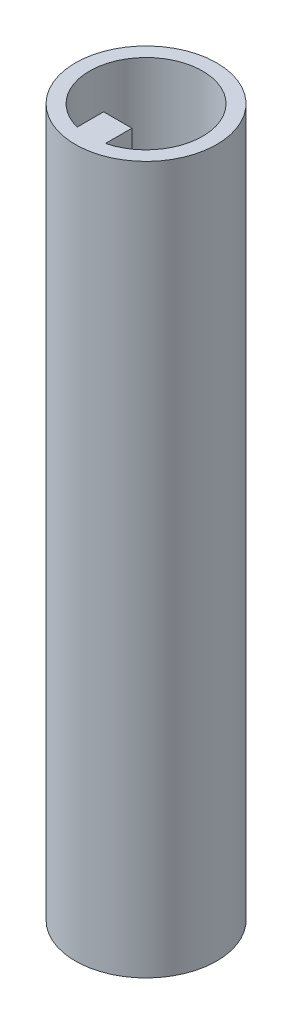
ISO-10303-21;
HEADER;
FILE_DESCRIPTION(('STEP AP214'),'2;1');
FILE_NAME('part.step','',(''),(''),'','','');
FILE_SCHEMA(('AUTOMOTIVE_DESIGN { 1 0 10303 214 1 1 1 1 }'));
ENDSEC;
DATA;
#1=APPLICATION_CONTEXT('core data for automotive mechanical design processes');
#2=APPLICATION_PROTOCOL_DEFINITION('international standard','automotive_design',2000,#1);
#3=PRODUCT_CONTEXT('',#1,'mechanical');
#4=PRODUCT('Part','Part','',(#3));
#5=PRODUCT_RELATED_PRODUCT_CATEGORY('part','',(#4));
#6=PRODUCT_DEFINITION_FORMATION('','',#4);
#7=PRODUCT_DEFINITION_CONTEXT('part definition',#1,'design');
#8=PRODUCT_DEFINITION('design','',#6,#7);
#9=PRODUCT_DEFINITION_SHAPE('','',#8);
#10=(LENGTH_UNIT() NAMED_UNIT(*) SI_UNIT(.MILLI.,.METRE.));
#11=(NAMED_UNIT(*) PLANE_ANGLE_UNIT() SI_UNIT($,.RADIAN.));
#12=(NAMED_UNIT(*) SI_UNIT($,.STERADIAN.) SOLID_ANGLE_UNIT());
#13=UNCERTAINTY_MEASURE_WITH_UNIT(LENGTH_MEASURE(1.E-05),#10,'distance_accuracy_value','');
#14=(GEOMETRIC_REPRESENTATION_CONTEXT(3) GLOBAL_UNCERTAINTY_ASSIGNED_CONTEXT((#13)) GLOBAL_UNIT_ASSIGNED_CONTEXT((#10,
#11,#12)) REPRESENTATION_CONTEXT('',''));
#15=CARTESIAN_POINT('',(0.,0.,0.));
#16=DIRECTION('',(0.,0.,1.));
#17=DIRECTION('',(1.,0.,0.));
#18=AXIS2_PLACEMENT_3D('',#15,#16,#17);
#19=CARTESIAN_POINT('',(-3.03941436278194,-156.611885126808,30.6195109088026));
#20=DIRECTION('',(0.,1.,0.));
#21=DIRECTION('',(0.,0.,1.));
#22=AXIS2_PLACEMENT_3D('',#19,#20,#21);
#23=CYLINDRICAL_SURFACE('',#22,8.);
#24=DIRECTION('',(0.,1.,0.));
#25=VECTOR('',#24,1.);
#26=CARTESIAN_POINT('',(-5.03941436278194,-156.611885126808,38.3654776012174));
#27=LINE('',#26,#25);
#28=CARTESIAN_POINT('',(-5.03941436278194,-153.611885126808,38.3654776012174));
#29=VERTEX_POINT('',#28);
#30=CARTESIAN_POINT('',(-5.03941436278194,-56.6118851268083,38.3654776012174));
#31=VERTEX_POINT('',#30);
#32=EDGE_CURVE('E55',#29,#31,#27,.T.);
#33=ORIENTED_EDGE('',*,*,#32,.F.);
#34=CARTESIAN_POINT('',(-3.03941436278194,-153.611885126808,30.6195109088026));
#35=DIRECTION('',(0.,-1.,0.));
#36=DIRECTION('',(0.,0.,-1.));
#37=AXIS2_PLACEMENT_3D('',#34,#35,#36);
#38=CIRCLE('',#37,8.);
#39=CARTESIAN_POINT('',(-1.03941436278194,-153.611885126808,38.3654776012174));
#40=VERTEX_POINT('',#39);
#41=EDGE_CURVE('E49',#29,#40,#38,.T.);
#42=ORIENTED_EDGE('',*,*,#41,.T.);
#43=DIRECTION('',(0.,1.,0.));
#44=VECTOR('',#43,1.);
#45=CARTESIAN_POINT('',(-1.03941436278194,-156.611885126808,38.3654776012174));
#46=LINE('',#45,#44);
#47=CARTESIAN_POINT('',(-1.03941436278194,-56.6118851268083,38.3654776012174));
#48=VERTEX_POINT('',#47);
#49=EDGE_CURVE('E92',#40,#48,#46,.T.);
#50=ORIENTED_EDGE('',*,*,#49,.T.);
#51=CARTESIAN_POINT('',(-3.03941436278194,-56.6118851268083,30.6195109088026));
#52=DIRECTION('',(0.,-1.,0.));
#53=DIRECTION('',(0.,0.,-1.));
#54=AXIS2_PLACEMENT_3D('',#51,#52,#53);
#55=CIRCLE('',#54,8.);
#56=EDGE_CURVE('E124',#31,#48,#55,.T.);
#57=ORIENTED_EDGE('',*,*,#56,.F.);
#58=EDGE_LOOP('',(#33,#42,#50,#57));
#59=FACE_BOUND('',#58,.T.);
#60=ADVANCED_FACE('F32',(#59),#23,.F.);
#61=CARTESIAN_POINT('',(-1.03941436278194,-156.611885126808,38.3654776012174));
#62=DIRECTION('',(1.,0.,0.));
#63=DIRECTION('',(0.,0.,-1.));
#64=AXIS2_PLACEMENT_3D('',#61,#62,#63);
#65=PLANE('',#64);
#66=ORIENTED_EDGE('',*,*,#49,.F.);
#67=DIRECTION('',(0.,0.,-1.));
#68=VECTOR('',#67,1.);
#69=CARTESIAN_POINT('',(-1.03941436278194,-153.611885126808,38.3654776012174));
#70=LINE('',#69,#68);
#71=CARTESIAN_POINT('',(-1.03941436278194,-153.611885126808,34.6195109088026));
#72=VERTEX_POINT('',#71);
#73=EDGE_CURVE('E84',#40,#72,#70,.T.);
#74=ORIENTED_EDGE('',*,*,#73,.T.);
#75=DIRECTION('',(0.,1.,0.));
#76=VECTOR('',#75,1.);
#77=CARTESIAN_POINT('',(-1.03941436278194,-156.611885126808,34.6195109088026));
#78=LINE('',#77,#76);
#79=CARTESIAN_POINT('',(-1.03941436278194,-56.6118851268083,34.6195109088026));
#80=VERTEX_POINT('',#79);
#81=EDGE_CURVE('E83',#72,#80,#78,.T.);
#82=ORIENTED_EDGE('',*,*,#81,.T.);
#83=DIRECTION('',(0.,0.,-1.));
#84=VECTOR('',#83,1.);
#85=CARTESIAN_POINT('',(-1.03941436278194,-56.6118851268083,38.3654776012174));
#86=LINE('',#85,#84);
#87=EDGE_CURVE('E127',#48,#80,#86,.T.);
#88=ORIENTED_EDGE('',*,*,#87,.F.);
#89=EDGE_LOOP('',(#66,#74,#82,#88));
#90=FACE_BOUND('',#89,.T.);
#91=ADVANCED_FACE('F136',(#90),#65,.T.);
#92=CARTESIAN_POINT('',(-1.03941436278194,-156.611885126808,34.6195109088026));
#93=DIRECTION('',(0.,0.,-1.));
#94=DIRECTION('',(-1.,0.,0.));
#95=AXIS2_PLACEMENT_3D('',#92,#93,#94);
#96=PLANE('',#95);
#97=ORIENTED_EDGE('',*,*,#81,.F.);
#98=DIRECTION('',(-1.,0.,0.));
#99=VECTOR('',#98,1.);
#100=CARTESIAN_POINT('',(-1.03941436278194,-153.611885126808,34.6195109088026));
#101=LINE('',#100,#99);
#102=CARTESIAN_POINT('',(-5.03941436278194,-153.611885126808,34.6195109088026));
#103=VERTEX_POINT('',#102);
#104=EDGE_CURVE('E75',#72,#103,#101,.T.);
#105=ORIENTED_EDGE('',*,*,#104,.T.);
#106=DIRECTION('',(0.,1.,0.));
#107=VECTOR('',#106,1.);
#108=CARTESIAN_POINT('',(-5.03941436278194,-156.611885126808,34.6195109088026));
#109=LINE('',#108,#107);
#110=CARTESIAN_POINT('',(-5.03941436278194,-56.6118851268083,34.6195109088026));
#111=VERTEX_POINT('',#110);
#112=EDGE_CURVE('E82',#103,#111,#109,.T.);
#113=ORIENTED_EDGE('',*,*,#112,.T.);
#114=DIRECTION('',(-1.,0.,0.));
#115=VECTOR('',#114,1.);
#116=CARTESIAN_POINT('',(-1.03941436278194,-56.6118851268083,34.6195109088026));
#117=LINE('',#116,#115);
#118=EDGE_CURVE('E130',#80,#111,#117,.T.);
#119=ORIENTED_EDGE('',*,*,#118,.F.);
#120=EDGE_LOOP('',(#97,#105,#113,#119));
#121=FACE_BOUND('',#120,.T.);
#122=ADVANCED_FACE('F80',(#121),#96,.T.);
#123=CARTESIAN_POINT('',(-5.03941436278194,-156.611885126808,34.6195109088026));
#124=DIRECTION('',(-1.,0.,0.));
#125=DIRECTION('',(0.,0.,1.));
#126=AXIS2_PLACEMENT_3D('',#123,#124,#125);
#127=PLANE('',#126);
#128=ORIENTED_EDGE('',*,*,#112,.F.);
#129=DIRECTION('',(0.,0.,1.));
#130=VECTOR('',#129,1.);
#131=CARTESIAN_POINT('',(-5.03941436278194,-153.611885126808,34.6195109088026));
#132=LINE('',#131,#130);
#133=EDGE_CURVE('E11',#103,#29,#132,.T.);
#134=ORIENTED_EDGE('',*,*,#133,.T.);
#135=ORIENTED_EDGE('',*,*,#32,.T.);
#136=DIRECTION('',(0.,0.,1.));
#137=VECTOR('',#136,1.);
#138=CARTESIAN_POINT('',(-5.03941436278194,-56.6118851268083,34.6195109088026));
#139=LINE('',#138,#137);
#140=EDGE_CURVE('E89',#111,#31,#139,.T.);
#141=ORIENTED_EDGE('',*,*,#140,.F.);
#142=EDGE_LOOP('',(#128,#134,#135,#141));
#143=FACE_BOUND('',#142,.T.);
#144=ADVANCED_FACE('F87',(#143),#127,.T.);
#145=CARTESIAN_POINT('',(-3.03941436278194,-156.611885126808,30.6195109088026));
#146=DIRECTION('',(0.,-1.,0.));
#147=DIRECTION('',(0.,0.,-1.));
#148=AXIS2_PLACEMENT_3D('',#145,#146,#147);
#149=PLANE('',#148);
#150=CARTESIAN_POINT('',(-3.03941436278194,-156.611885126808,37.5774004179791));
#151=DIRECTION('',(0.,-1.,0.));
#152=DIRECTION('',(0.,0.,-1.));
#153=AXIS2_PLACEMENT_3D('',#150,#151,#152);
#154=CIRCLE('',#153,0.899999999999999);
#155=CARTESIAN_POINT('',(-3.03941436278194,-156.611885126808,36.6774004179791));
#156=VERTEX_POINT('',#155);
#157=EDGE_CURVE('E250',#156,#156,#154,.T.);
#158=ORIENTED_EDGE('',*,*,#157,.F.);
#159=EDGE_LOOP('',(#158));
#160=FACE_BOUND('',#159,.T.);
#161=CARTESIAN_POINT('',(3.91847514639478,-156.611885126808,30.6195109088027));
#162=DIRECTION('',(0.,-1.,0.));
#163=DIRECTION('',(0.,0.,-1.));
#164=AXIS2_PLACEMENT_3D('',#161,#162,#163);
#165=CIRCLE('',#164,0.899999999999998);
#166=CARTESIAN_POINT('',(3.91847514639478,-156.611885126808,29.7195109088027));
#167=VERTEX_POINT('',#166);
#168=EDGE_CURVE('E253',#167,#167,#165,.T.);
#169=ORIENTED_EDGE('',*,*,#168,.F.);
#170=EDGE_LOOP('',(#169));
#171=FACE_BOUND('',#170,.T.);
#172=CARTESIAN_POINT('',(-3.03941436278159,-156.611885126808,23.661621399626));
#173=DIRECTION('',(0.,-1.,0.));
#174=DIRECTION('',(0.,0.,-1.));
#175=AXIS2_PLACEMENT_3D('',#172,#173,#174);
#176=CIRCLE('',#175,0.899999999999999);
#177=CARTESIAN_POINT('',(-3.03941436278159,-156.611885126808,22.761621399626));
#178=VERTEX_POINT('',#177);
#179=EDGE_CURVE('E258',#178,#178,#176,.T.);
#180=ORIENTED_EDGE('',*,*,#179,.F.);
#181=EDGE_LOOP('',(#180));
#182=FACE_BOUND('',#181,.T.);
#183=CARTESIAN_POINT('',(-9.99730387195827,-156.611885126808,30.6195109088024));
#184=DIRECTION('',(0.,-1.,0.));
#185=DIRECTION('',(0.,0.,-1.));
#186=AXIS2_PLACEMENT_3D('',#183,#184,#185);
#187=CIRCLE('',#186,0.899999999999999);
#188=CARTESIAN_POINT('',(-9.99730387195827,-156.611885126808,29.7195109088024));
#189=VERTEX_POINT('',#188);
#190=EDGE_CURVE('E260',#189,#189,#187,.T.);
#191=ORIENTED_EDGE('',*,*,#190,.F.);
#192=EDGE_LOOP('',(#191));
#193=FACE_BOUND('',#192,.T.);
#194=CARTESIAN_POINT('',(-3.03941436278194,-156.611885126808,30.6195109088026));
#195=DIRECTION('',(0.,-1.,0.));
#196=DIRECTION('',(0.,0.,-1.));
#197=AXIS2_PLACEMENT_3D('',#194,#195,#196);
#198=CIRCLE('',#197,10.);
#199=CARTESIAN_POINT('',(-3.03941436278194,-156.611885126808,20.6195109088026));
#200=VERTEX_POINT('',#199);
#201=EDGE_CURVE('E41',#200,#200,#198,.T.);
#202=ORIENTED_EDGE('',*,*,#201,.T.);
#203=EDGE_LOOP('',(#202));
#204=FACE_BOUND('',#203,.T.);
#205=CARTESIAN_POINT('',(-3.03941436278194,-156.611885126808,30.6195109088026));
#206=DIRECTION('',(0.,-1.,0.));
#207=DIRECTION('',(0.,0.,-1.));
#208=AXIS2_PLACEMENT_3D('',#205,#206,#207);
#209=CIRCLE('',#208,2.75);
#210=CARTESIAN_POINT('',(-3.03941436278194,-156.611885126808,27.8695109088026));
#211=VERTEX_POINT('',#210);
#212=EDGE_CURVE('E111',#211,#211,#209,.T.);
#213=ORIENTED_EDGE('',*,*,#212,.F.);
#214=EDGE_LOOP('',(#213));
#215=FACE_BOUND('',#214,.T.);
#216=ADVANCED_FACE('F146',(#160,#171,#182,#193,#204,#215),#149,.T.);
#217=CARTESIAN_POINT('',(-3.03941436278194,-56.6118851268083,30.6195109088026));
#218=DIRECTION('',(0.,-1.,0.));
#219=DIRECTION('',(0.,0.,-1.));
#220=AXIS2_PLACEMENT_3D('',#217,#218,#219);
#221=PLANE('',#220);
#222=CARTESIAN_POINT('',(-3.03941436278194,-56.6118851268083,30.6195109088026));
#223=DIRECTION('',(0.,-1.,0.));
#224=DIRECTION('',(0.,0.,-1.));
#225=AXIS2_PLACEMENT_3D('',#222,#223,#224);
#226=CIRCLE('',#225,10.);
#227=CARTESIAN_POINT('',(-3.03941436278194,-56.6118851268083,20.6195109088026));
#228=VERTEX_POINT('',#227);
#229=EDGE_CURVE('E98',#228,#228,#226,.T.);
#230=ORIENTED_EDGE('',*,*,#229,.F.);
#231=EDGE_LOOP('',(#230));
#232=FACE_BOUND('',#231,.T.);
#233=ORIENTED_EDGE('',*,*,#56,.T.);
#234=ORIENTED_EDGE('',*,*,#87,.T.);
#235=ORIENTED_EDGE('',*,*,#118,.T.);
#236=ORIENTED_EDGE('',*,*,#140,.T.);
#237=EDGE_LOOP('',(#233,#234,#235,#236));
#238=FACE_BOUND('',#237,.T.);
#239=ADVANCED_FACE('F132',(#232,#238),#221,.F.);
#240=CARTESIAN_POINT('',(-3.03941436278194,-156.611885126808,30.6195109088026));
#241=DIRECTION('',(0.,1.,0.));
#242=DIRECTION('',(0.,0.,1.));
#243=AXIS2_PLACEMENT_3D('',#240,#241,#242);
#244=CYLINDRICAL_SURFACE('',#243,10.);
#245=ORIENTED_EDGE('',*,*,#201,.F.);
#246=EDGE_LOOP('',(#245));
#247=FACE_BOUND('',#246,.T.);
#248=ORIENTED_EDGE('',*,*,#229,.T.);
#249=EDGE_LOOP('',(#248));
#250=FACE_BOUND('',#249,.T.);
#251=ADVANCED_FACE('F34',(#247,#250),#244,.T.);
#252=CARTESIAN_POINT('',(-3.03941436278194,-153.611885126808,30.6195109088026));
#253=DIRECTION('',(0.,-1.,0.));
#254=DIRECTION('',(0.,0.,-1.));
#255=AXIS2_PLACEMENT_3D('',#252,#253,#254);
#256=PLANE('',#255);
#257=CARTESIAN_POINT('',(3.91847514639478,-153.611885126808,30.6195109088027));
#258=DIRECTION('',(0.,-1.,0.));
#259=DIRECTION('',(0.,0.,-1.));
#260=AXIS2_PLACEMENT_3D('',#257,#258,#259);
#261=CIRCLE('',#260,0.899999999999998);
#262=CARTESIAN_POINT('',(3.91847514639478,-153.611885126808,29.7195109088027));
#263=VERTEX_POINT('',#262);
#264=EDGE_CURVE('E36',#263,#263,#261,.T.);
#265=ORIENTED_EDGE('',*,*,#264,.T.);
#266=EDGE_LOOP('',(#265));
#267=FACE_BOUND('',#266,.T.);
#268=CARTESIAN_POINT('',(-3.03941436278159,-153.611885126808,23.661621399626));
#269=DIRECTION('',(0.,-1.,0.));
#270=DIRECTION('',(0.,0.,-1.));
#271=AXIS2_PLACEMENT_3D('',#268,#269,#270);
#272=CIRCLE('',#271,0.899999999999999);
#273=CARTESIAN_POINT('',(-3.03941436278159,-153.611885126808,22.761621399626));
#274=VERTEX_POINT('',#273);
#275=EDGE_CURVE('E105',#274,#274,#272,.T.);
#276=ORIENTED_EDGE('',*,*,#275,.T.);
#277=EDGE_LOOP('',(#276));
#278=FACE_BOUND('',#277,.T.);
#279=CARTESIAN_POINT('',(-9.99730387195827,-153.611885126808,30.6195109088024));
#280=DIRECTION('',(0.,-1.,0.));
#281=DIRECTION('',(0.,0.,-1.));
#282=AXIS2_PLACEMENT_3D('',#279,#280,#281);
#283=CIRCLE('',#282,0.899999999999999);
#284=CARTESIAN_POINT('',(-9.99730387195827,-153.611885126808,29.7195109088024));
#285=VERTEX_POINT('',#284);
#286=EDGE_CURVE('E103',#285,#285,#283,.T.);
#287=ORIENTED_EDGE('',*,*,#286,.T.);
#288=EDGE_LOOP('',(#287));
#289=FACE_BOUND('',#288,.T.);
#290=ORIENTED_EDGE('',*,*,#41,.F.);
#291=ORIENTED_EDGE('',*,*,#133,.F.);
#292=ORIENTED_EDGE('',*,*,#104,.F.);
#293=ORIENTED_EDGE('',*,*,#73,.F.);
#294=EDGE_LOOP('',(#290,#291,#292,#293));
#295=FACE_BOUND('',#294,.T.);
#296=CARTESIAN_POINT('',(-3.03941436278194,-153.611885126808,30.6195109088026));
#297=DIRECTION('',(0.,-1.,0.));
#298=DIRECTION('',(0.,0.,-1.));
#299=AXIS2_PLACEMENT_3D('',#296,#297,#298);
#300=CIRCLE('',#299,2.75);
#301=CARTESIAN_POINT('',(-3.03941436278194,-153.611885126808,27.8695109088026));
#302=VERTEX_POINT('',#301);
#303=EDGE_CURVE('E85',#302,#302,#300,.T.);
#304=ORIENTED_EDGE('',*,*,#303,.T.);
#305=EDGE_LOOP('',(#304));
#306=FACE_BOUND('',#305,.T.);
#307=ADVANCED_FACE('F73',(#267,#278,#289,#295,#306),#256,.F.);
#308=CARTESIAN_POINT('',(-3.03941436278194,-153.611885126808,30.6195109088026));
#309=DIRECTION('',(0.,-1.,0.));
#310=DIRECTION('',(0.,0.,-1.));
#311=AXIS2_PLACEMENT_3D('',#308,#309,#310);
#312=CYLINDRICAL_SURFACE('',#311,2.75);
#313=ORIENTED_EDGE('',*,*,#303,.F.);
#314=EDGE_LOOP('',(#313));
#315=FACE_BOUND('',#314,.T.);
#316=ORIENTED_EDGE('',*,*,#212,.T.);
#317=EDGE_LOOP('',(#316));
#318=FACE_BOUND('',#317,.T.);
#319=ADVANCED_FACE('F160',(#315,#318),#312,.F.);
#320=CARTESIAN_POINT('',(-9.99730387195827,-146.611885126808,30.6195109088024));
#321=DIRECTION('',(0.,-1.,0.));
#322=DIRECTION('',(0.,0.,-1.));
#323=AXIS2_PLACEMENT_3D('',#320,#321,#322);
#324=CYLINDRICAL_SURFACE('',#323,0.899999999999999);
#325=ORIENTED_EDGE('',*,*,#190,.T.);
#326=EDGE_LOOP('',(#325));
#327=FACE_BOUND('',#326,.T.);
#328=ORIENTED_EDGE('',*,*,#286,.F.);
#329=EDGE_LOOP('',(#328));
#330=FACE_BOUND('',#329,.T.);
#331=ADVANCED_FACE('F168',(#327,#330),#324,.F.);
#332=CARTESIAN_POINT('',(-3.03941436278159,-146.611885126808,23.661621399626));
#333=DIRECTION('',(0.,-1.,0.));
#334=DIRECTION('',(0.,0.,-1.));
#335=AXIS2_PLACEMENT_3D('',#332,#333,#334);
#336=CYLINDRICAL_SURFACE('',#335,0.899999999999999);
#337=ORIENTED_EDGE('',*,*,#179,.T.);
#338=EDGE_LOOP('',(#337));
#339=FACE_BOUND('',#338,.T.);
#340=ORIENTED_EDGE('',*,*,#275,.F.);
#341=EDGE_LOOP('',(#340));
#342=FACE_BOUND('',#341,.T.);
#343=ADVANCED_FACE('F205',(#339,#342),#336,.F.);
#344=CARTESIAN_POINT('',(3.91847514639478,-146.611885126808,30.6195109088027));
#345=DIRECTION('',(0.,-1.,0.));
#346=DIRECTION('',(0.,0.,-1.));
#347=AXIS2_PLACEMENT_3D('',#344,#345,#346);
#348=CYLINDRICAL_SURFACE('',#347,0.899999999999998);
#349=ORIENTED_EDGE('',*,*,#168,.T.);
#350=EDGE_LOOP('',(#349));
#351=FACE_BOUND('',#350,.T.);
#352=ORIENTED_EDGE('',*,*,#264,.F.);
#353=EDGE_LOOP('',(#352));
#354=FACE_BOUND('',#353,.T.);
#355=ADVANCED_FACE('F214',(#351,#354),#348,.F.);
#356=CARTESIAN_POINT('',(-3.03941436278194,-146.611885126808,37.5774004179791));
#357=DIRECTION('',(0.,-1.,0.));
#358=DIRECTION('',(0.,0.,-1.));
#359=AXIS2_PLACEMENT_3D('',#356,#357,#358);
#360=CYLINDRICAL_SURFACE('',#359,0.899999999999999);
#361=CARTESIAN_POINT('',(-3.03941436278194,-146.611885126808,37.5774004179791));
#362=DIRECTION('',(0.,-1.,0.));
#363=DIRECTION('',(0.,0.,-1.));
#364=AXIS2_PLACEMENT_3D('',#361,#362,#363);
#365=CIRCLE('',#364,0.899999999999999);
#366=CARTESIAN_POINT('',(-3.03941436278194,-146.611885126808,36.6774004179791));
#367=VERTEX_POINT('',#366);
#368=EDGE_CURVE('E106',#367,#367,#365,.T.);
#369=ORIENTED_EDGE('',*,*,#368,.F.);
#370=EDGE_LOOP('',(#369));
#371=FACE_BOUND('',#370,.T.);
#372=ORIENTED_EDGE('',*,*,#157,.T.);
#373=EDGE_LOOP('',(#372));
#374=FACE_BOUND('',#373,.T.);
#375=ADVANCED_FACE('F224',(#371,#374),#360,.F.);
#376=CARTESIAN_POINT('',(-3.03941436278194,-146.611885126808,37.5774004179791));
#377=DIRECTION('',(0.,-1.,0.));
#378=DIRECTION('',(0.,0.,-1.));
#379=AXIS2_PLACEMENT_3D('',#376,#377,#378);
#380=PLANE('',#379);
#381=ORIENTED_EDGE('',*,*,#368,.T.);
#382=EDGE_LOOP('',(#381));
#383=FACE_BOUND('',#382,.T.);
#384=ADVANCED_FACE('F234',(#383),#380,.T.);
#385=CLOSED_SHELL('',(#60,#91,#122,#144,#216,#239,#251,#307,#319,#331,#343,#355,#375,#384));
#386=MANIFOLD_SOLID_BREP('B2',#385);
#387=ADVANCED_BREP_SHAPE_REPRESENTATION('',(#18,#386),#14);
#388=SHAPE_DEFINITION_REPRESENTATION(#9,#387);
ENDSEC;
END-ISO-10303-21;
